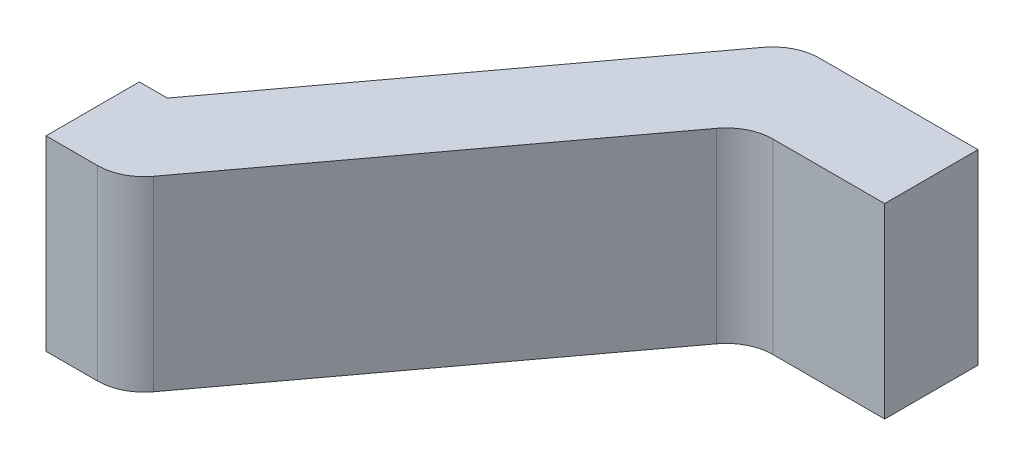
ISO-10303-21;
HEADER;
FILE_DESCRIPTION(('STEP AP214'),'2;1');
FILE_NAME('part.step','',(''),(''),'','','');
FILE_SCHEMA(('AUTOMOTIVE_DESIGN { 1 0 10303 214 1 1 1 1 }'));
ENDSEC;
DATA;
#1=APPLICATION_CONTEXT('core data for automotive mechanical design processes');
#2=APPLICATION_PROTOCOL_DEFINITION('international standard','automotive_design',2000,#1);
#3=PRODUCT_CONTEXT('',#1,'mechanical');
#4=PRODUCT('Part','Part','',(#3));
#5=PRODUCT_RELATED_PRODUCT_CATEGORY('part','',(#4));
#6=PRODUCT_DEFINITION_FORMATION('','',#4);
#7=PRODUCT_DEFINITION_CONTEXT('part definition',#1,'design');
#8=PRODUCT_DEFINITION('design','',#6,#7);
#9=PRODUCT_DEFINITION_SHAPE('','',#8);
#10=(LENGTH_UNIT() NAMED_UNIT(*) SI_UNIT(.MILLI.,.METRE.));
#11=(NAMED_UNIT(*) PLANE_ANGLE_UNIT() SI_UNIT($,.RADIAN.));
#12=(NAMED_UNIT(*) SI_UNIT($,.STERADIAN.) SOLID_ANGLE_UNIT());
#13=UNCERTAINTY_MEASURE_WITH_UNIT(LENGTH_MEASURE(1.E-05),#10,'distance_accuracy_value','');
#14=(GEOMETRIC_REPRESENTATION_CONTEXT(3) GLOBAL_UNCERTAINTY_ASSIGNED_CONTEXT((#13)) GLOBAL_UNIT_ASSIGNED_CONTEXT((#10,
#11,#12)) REPRESENTATION_CONTEXT('',''));
#15=CARTESIAN_POINT('',(0.,0.,0.));
#16=DIRECTION('',(0.,0.,1.));
#17=DIRECTION('',(1.,0.,0.));
#18=AXIS2_PLACEMENT_3D('',#15,#16,#17);
#19=CARTESIAN_POINT('',(2.6,-2.11,0.205));
#20=DIRECTION('',(0.,0.,1.));
#21=DIRECTION('',(1.,0.,0.));
#22=AXIS2_PLACEMENT_3D('',#19,#20,#21);
#23=PLANE('',#22);
#24=DIRECTION('',(1.,0.,0.));
#25=VECTOR('',#24,1.);
#26=CARTESIAN_POINT('',(2.6,-1.7,0.205));
#27=LINE('',#26,#25);
#28=CARTESIAN_POINT('',(2.754632601552,-1.7,0.205));
#29=VERTEX_POINT('',#28);
#30=CARTESIAN_POINT('',(3.,-1.7,0.205));
#31=VERTEX_POINT('',#30);
#32=EDGE_CURVE('E11',#29,#31,#27,.T.);
#33=ORIENTED_EDGE('',*,*,#32,.F.);
#34=DIRECTION('',(0.,1.,0.));
#35=VECTOR('',#34,1.);
#36=CARTESIAN_POINT('',(2.754632601552,-2.11,0.205));
#37=LINE('',#36,#35);
#38=CARTESIAN_POINT('',(2.754632601552,-2.11,0.205));
#39=VERTEX_POINT('',#38);
#40=EDGE_CURVE('E24',#39,#29,#37,.T.);
#41=ORIENTED_EDGE('',*,*,#40,.F.);
#42=DIRECTION('',(1.,0.,0.));
#43=VECTOR('',#42,1.);
#44=CARTESIAN_POINT('',(2.6,-2.11,0.205));
#45=LINE('',#44,#43);
#46=CARTESIAN_POINT('',(3.,-2.11,0.205));
#47=VERTEX_POINT('',#46);
#48=EDGE_CURVE('E172',#39,#47,#45,.T.);
#49=ORIENTED_EDGE('',*,*,#48,.T.);
#50=DIRECTION('',(0.,1.,0.));
#51=VECTOR('',#50,1.);
#52=CARTESIAN_POINT('',(3.,-2.11,0.205));
#53=LINE('',#52,#51);
#54=EDGE_CURVE('E170',#47,#31,#53,.T.);
#55=ORIENTED_EDGE('',*,*,#54,.T.);
#56=EDGE_LOOP('',(#33,#41,#49,#55));
#57=FACE_BOUND('',#56,.T.);
#58=ADVANCED_FACE('F17',(#57),#23,.T.);
#59=CARTESIAN_POINT('',(2.6,-1.7,0.));
#60=DIRECTION('',(0.,1.,0.));
#61=DIRECTION('',(0.,0.,1.));
#62=AXIS2_PLACEMENT_3D('',#59,#60,#61);
#63=PLANE('',#62);
#64=DIRECTION('',(1.,0.,0.));
#65=VECTOR('',#64,1.);
#66=CARTESIAN_POINT('',(2.6,-1.7,0.));
#67=LINE('',#66,#65);
#68=CARTESIAN_POINT('',(2.651544200517,-1.7,0.));
#69=VERTEX_POINT('',#68);
#70=CARTESIAN_POINT('',(3.,-1.7,0.));
#71=VERTEX_POINT('',#70);
#72=EDGE_CURVE('E168',#69,#71,#67,.T.);
#73=ORIENTED_EDGE('',*,*,#72,.F.);
#74=CARTESIAN_POINT('',(2.651544200517,-1.7,0.1025));
#75=DIRECTION('',(0.,1.,0.));
#76=DIRECTION('',(0.,0.,1.));
#77=AXIS2_PLACEMENT_3D('',#74,#75,#76);
#78=CIRCLE('',#77,0.1025);
#79=CARTESIAN_POINT('',(2.569262956102,-1.7,0.0413767898629));
#80=VERTEX_POINT('',#79);
#81=EDGE_CURVE('E118',#69,#80,#78,.T.);
#82=ORIENTED_EDGE('',*,*,#81,.T.);
#83=DIRECTION('',(-0.596324001338072,0.,0.802743847954097));
#84=VECTOR('',#83,1.);
#85=CARTESIAN_POINT('',(2.6,-1.7,0.));
#86=LINE('',#85,#84);
#87=CARTESIAN_POINT('',(2.011474087796,-1.7,0.792246420274));
#88=VERTEX_POINT('',#87);
#89=EDGE_CURVE('E165',#80,#88,#86,.T.);
#90=ORIENTED_EDGE('',*,*,#89,.T.);
#91=DIRECTION('',(1.,0.,0.));
#92=VECTOR('',#91,1.);
#93=CARTESIAN_POINT('',(1.95,-1.7,0.792246420274));
#94=LINE('',#93,#92);
#95=CARTESIAN_POINT('',(1.95,-1.7,0.792246420274));
#96=VERTEX_POINT('',#95);
#97=EDGE_CURVE('E162',#96,#88,#94,.T.);
#98=ORIENTED_EDGE('',*,*,#97,.F.);
#99=DIRECTION('',(0.,0.,1.));
#100=VECTOR('',#99,1.);
#101=CARTESIAN_POINT('',(1.95,-1.7,0.792246420274));
#102=LINE('',#101,#100);
#103=CARTESIAN_POINT('',(1.95,-1.7,0.997246420274));
#104=VERTEX_POINT('',#103);
#105=EDGE_CURVE('E160',#96,#104,#102,.T.);
#106=ORIENTED_EDGE('',*,*,#105,.T.);
#107=DIRECTION('',(1.,0.,0.));
#108=VECTOR('',#107,1.);
#109=CARTESIAN_POINT('',(1.95,-1.7,0.997246420274));
#110=LINE('',#109,#108);
#111=CARTESIAN_POINT('',(2.063018288313,-1.7,0.997246420274));
#112=VERTEX_POINT('',#111);
#113=EDGE_CURVE('E158',#104,#112,#110,.T.);
#114=ORIENTED_EDGE('',*,*,#113,.T.);
#115=CARTESIAN_POINT('',(2.063018288313,-1.7,0.894746420274));
#116=DIRECTION('',(0.,-1.,0.));
#117=DIRECTION('',(0.,0.,1.));
#118=AXIS2_PLACEMENT_3D('',#115,#116,#117);
#119=CIRCLE('',#118,0.1025);
#120=CARTESIAN_POINT('',(2.145299532729,-1.7,0.955869630411));
#121=VERTEX_POINT('',#120);
#122=EDGE_CURVE('E155',#121,#112,#119,.T.);
#123=ORIENTED_EDGE('',*,*,#122,.F.);
#124=DIRECTION('',(-0.596324001338072,0.,0.802743847954097));
#125=VECTOR('',#124,1.);
#126=CARTESIAN_POINT('',(2.764562488831,-1.7,0.122246420274));
#127=LINE('',#126,#125);
#128=CARTESIAN_POINT('',(2.672351357136,-1.7,0.246376789863));
#129=VERTEX_POINT('',#128);
#130=EDGE_CURVE('E152',#129,#121,#127,.T.);
#131=ORIENTED_EDGE('',*,*,#130,.F.);
#132=CARTESIAN_POINT('',(2.754632601552,-1.7,0.3075));
#133=DIRECTION('',(0.,1.,0.));
#134=DIRECTION('',(0.,0.,1.));
#135=AXIS2_PLACEMENT_3D('',#132,#133,#134);
#136=CIRCLE('',#135,0.1025);
#137=EDGE_CURVE('E149',#29,#129,#136,.T.);
#138=ORIENTED_EDGE('',*,*,#137,.F.);
#139=ORIENTED_EDGE('',*,*,#32,.T.);
#140=DIRECTION('',(0.,0.,1.));
#141=VECTOR('',#140,1.);
#142=CARTESIAN_POINT('',(3.,-1.7,0.));
#143=LINE('',#142,#141);
#144=EDGE_CURVE('E146',#71,#31,#143,.T.);
#145=ORIENTED_EDGE('',*,*,#144,.F.);
#146=EDGE_LOOP('',(#73,#82,#90,#98,#106,#114,#123,#131,#138,#139,#145));
#147=FACE_BOUND('',#146,.T.);
#148=ADVANCED_FACE('F178',(#147),#63,.T.);
#149=CARTESIAN_POINT('',(2.754632601552,-2.11,0.3075));
#150=DIRECTION('',(0.,1.,0.));
#151=DIRECTION('',(0.,0.,-1.));
#152=AXIS2_PLACEMENT_3D('',#149,#150,#151);
#153=CYLINDRICAL_SURFACE('',#152,0.1025);
#154=ORIENTED_EDGE('',*,*,#40,.T.);
#155=ORIENTED_EDGE('',*,*,#137,.T.);
#156=DIRECTION('',(0.,1.,0.));
#157=VECTOR('',#156,1.);
#158=CARTESIAN_POINT('',(2.672351357136,-2.11,0.246376789863));
#159=LINE('',#158,#157);
#160=CARTESIAN_POINT('',(2.672351357136,-2.11,0.246376789863));
#161=VERTEX_POINT('',#160);
#162=EDGE_CURVE('E143',#161,#129,#159,.T.);
#163=ORIENTED_EDGE('',*,*,#162,.F.);
#164=CARTESIAN_POINT('',(2.754632601552,-2.11,0.3075));
#165=DIRECTION('',(0.,1.,0.));
#166=DIRECTION('',(0.,0.,1.));
#167=AXIS2_PLACEMENT_3D('',#164,#165,#166);
#168=CIRCLE('',#167,0.1025);
#169=EDGE_CURVE('E141',#39,#161,#168,.T.);
#170=ORIENTED_EDGE('',*,*,#169,.F.);
#171=EDGE_LOOP('',(#154,#155,#163,#170));
#172=FACE_BOUND('',#171,.T.);
#173=ADVANCED_FACE('F175',(#172),#153,.F.);
#174=CARTESIAN_POINT('',(3.,-2.11,0.));
#175=DIRECTION('',(1.,0.,0.));
#176=DIRECTION('',(0.,0.,1.));
#177=AXIS2_PLACEMENT_3D('',#174,#175,#176);
#178=PLANE('',#177);
#179=DIRECTION('',(0.,0.,1.));
#180=VECTOR('',#179,1.);
#181=CARTESIAN_POINT('',(3.,-2.11,0.));
#182=LINE('',#181,#180);
#183=CARTESIAN_POINT('',(3.,-2.11,0.));
#184=VERTEX_POINT('',#183);
#185=EDGE_CURVE('E139',#184,#47,#182,.T.);
#186=ORIENTED_EDGE('',*,*,#185,.F.);
#187=DIRECTION('',(0.,1.,0.));
#188=VECTOR('',#187,1.);
#189=CARTESIAN_POINT('',(3.,-2.11,0.));
#190=LINE('',#189,#188);
#191=EDGE_CURVE('E103',#184,#71,#190,.T.);
#192=ORIENTED_EDGE('',*,*,#191,.T.);
#193=ORIENTED_EDGE('',*,*,#144,.T.);
#194=ORIENTED_EDGE('',*,*,#54,.F.);
#195=EDGE_LOOP('',(#186,#192,#193,#194));
#196=FACE_BOUND('',#195,.T.);
#197=ADVANCED_FACE('F217',(#196),#178,.T.);
#198=CARTESIAN_POINT('',(2.6,-2.11,0.));
#199=DIRECTION('',(0.,1.,0.));
#200=DIRECTION('',(0.,0.,1.));
#201=AXIS2_PLACEMENT_3D('',#198,#199,#200);
#202=PLANE('',#201);
#203=ORIENTED_EDGE('',*,*,#185,.T.);
#204=ORIENTED_EDGE('',*,*,#48,.F.);
#205=ORIENTED_EDGE('',*,*,#169,.T.);
#206=DIRECTION('',(-0.596324001338072,0.,0.802743847954097));
#207=VECTOR('',#206,1.);
#208=CARTESIAN_POINT('',(2.764562488831,-2.11,0.122246420274));
#209=LINE('',#208,#207);
#210=CARTESIAN_POINT('',(2.145299532729,-2.11,0.955869630411));
#211=VERTEX_POINT('',#210);
#212=EDGE_CURVE('E135',#161,#211,#209,.T.);
#213=ORIENTED_EDGE('',*,*,#212,.T.);
#214=CARTESIAN_POINT('',(2.063018288313,-2.11,0.894746420274));
#215=DIRECTION('',(0.,-1.,0.));
#216=DIRECTION('',(0.,0.,1.));
#217=AXIS2_PLACEMENT_3D('',#214,#215,#216);
#218=CIRCLE('',#217,0.1025);
#219=CARTESIAN_POINT('',(2.063018288313,-2.11,0.997246420274));
#220=VERTEX_POINT('',#219);
#221=EDGE_CURVE('E132',#211,#220,#218,.T.);
#222=ORIENTED_EDGE('',*,*,#221,.T.);
#223=DIRECTION('',(1.,0.,0.));
#224=VECTOR('',#223,1.);
#225=CARTESIAN_POINT('',(1.95,-2.11,0.997246420274));
#226=LINE('',#225,#224);
#227=CARTESIAN_POINT('',(1.95,-2.11,0.997246420274));
#228=VERTEX_POINT('',#227);
#229=EDGE_CURVE('E130',#228,#220,#226,.T.);
#230=ORIENTED_EDGE('',*,*,#229,.F.);
#231=DIRECTION('',(0.,0.,1.));
#232=VECTOR('',#231,1.);
#233=CARTESIAN_POINT('',(1.95,-2.11,0.792246420274));
#234=LINE('',#233,#232);
#235=CARTESIAN_POINT('',(1.95,-2.11,0.792246420274));
#236=VERTEX_POINT('',#235);
#237=EDGE_CURVE('E128',#236,#228,#234,.T.);
#238=ORIENTED_EDGE('',*,*,#237,.F.);
#239=DIRECTION('',(1.,0.,0.));
#240=VECTOR('',#239,1.);
#241=CARTESIAN_POINT('',(1.95,-2.11,0.792246420274));
#242=LINE('',#241,#240);
#243=CARTESIAN_POINT('',(2.011474087796,-2.11,0.792246420274));
#244=VERTEX_POINT('',#243);
#245=EDGE_CURVE('E126',#236,#244,#242,.T.);
#246=ORIENTED_EDGE('',*,*,#245,.T.);
#247=DIRECTION('',(-0.596324001338072,0.,0.802743847954097));
#248=VECTOR('',#247,1.);
#249=CARTESIAN_POINT('',(2.6,-2.11,0.));
#250=LINE('',#249,#248);
#251=CARTESIAN_POINT('',(2.569262956102,-2.11,0.0413767898629));
#252=VERTEX_POINT('',#251);
#253=EDGE_CURVE('E111',#252,#244,#250,.T.);
#254=ORIENTED_EDGE('',*,*,#253,.F.);
#255=CARTESIAN_POINT('',(2.651544200517,-2.11,0.1025));
#256=DIRECTION('',(0.,1.,0.));
#257=DIRECTION('',(0.,0.,1.));
#258=AXIS2_PLACEMENT_3D('',#255,#256,#257);
#259=CIRCLE('',#258,0.1025);
#260=CARTESIAN_POINT('',(2.651544200517,-2.11,0.));
#261=VERTEX_POINT('',#260);
#262=EDGE_CURVE('E106',#261,#252,#259,.T.);
#263=ORIENTED_EDGE('',*,*,#262,.F.);
#264=DIRECTION('',(1.,0.,0.));
#265=VECTOR('',#264,1.);
#266=CARTESIAN_POINT('',(2.6,-2.11,0.));
#267=LINE('',#266,#265);
#268=EDGE_CURVE('E97',#261,#184,#267,.T.);
#269=ORIENTED_EDGE('',*,*,#268,.T.);
#270=EDGE_LOOP('',(#203,#204,#205,#213,#222,#230,#238,#246,#254,#263,#269));
#271=FACE_BOUND('',#270,.T.);
#272=ADVANCED_FACE('F109',(#271),#202,.F.);
#273=CARTESIAN_POINT('',(2.6,-2.11,0.));
#274=DIRECTION('',(0.,0.,1.));
#275=DIRECTION('',(1.,0.,0.));
#276=AXIS2_PLACEMENT_3D('',#273,#274,#275);
#277=PLANE('',#276);
#278=DIRECTION('',(0.,1.,0.));
#279=VECTOR('',#278,1.);
#280=CARTESIAN_POINT('',(2.651544200517,-2.11,0.));
#281=LINE('',#280,#279);
#282=EDGE_CURVE('E101',#261,#69,#281,.T.);
#283=ORIENTED_EDGE('',*,*,#282,.T.);
#284=ORIENTED_EDGE('',*,*,#72,.T.);
#285=ORIENTED_EDGE('',*,*,#191,.F.);
#286=ORIENTED_EDGE('',*,*,#268,.F.);
#287=EDGE_LOOP('',(#283,#284,#285,#286));
#288=FACE_BOUND('',#287,.T.);
#289=ADVANCED_FACE('F99',(#288),#277,.F.);
#290=CARTESIAN_POINT('',(2.651544200517,-2.11,0.1025));
#291=DIRECTION('',(0.,1.,0.));
#292=DIRECTION('',(0.,0.,-1.));
#293=AXIS2_PLACEMENT_3D('',#290,#291,#292);
#294=CYLINDRICAL_SURFACE('',#293,0.1025);
#295=ORIENTED_EDGE('',*,*,#262,.T.);
#296=DIRECTION('',(0.,1.,0.));
#297=VECTOR('',#296,1.);
#298=CARTESIAN_POINT('',(2.569262956102,-2.11,0.0413767898629));
#299=LINE('',#298,#297);
#300=EDGE_CURVE('E119',#252,#80,#299,.T.);
#301=ORIENTED_EDGE('',*,*,#300,.T.);
#302=ORIENTED_EDGE('',*,*,#81,.F.);
#303=ORIENTED_EDGE('',*,*,#282,.F.);
#304=EDGE_LOOP('',(#295,#301,#302,#303));
#305=FACE_BOUND('',#304,.T.);
#306=ADVANCED_FACE('F117',(#305),#294,.T.);
#307=CARTESIAN_POINT('',(2.6,-2.11,0.));
#308=DIRECTION('',(0.802743847954097,0.,0.596324001338072));
#309=DIRECTION('',(-0.596324001338072,0.,0.802743847954097));
#310=AXIS2_PLACEMENT_3D('',#307,#308,#309);
#311=PLANE('',#310);
#312=DIRECTION('',(0.,1.,0.));
#313=VECTOR('',#312,1.);
#314=CARTESIAN_POINT('',(2.011474087796,-2.11,0.792246420274));
#315=LINE('',#314,#313);
#316=EDGE_CURVE('E121',#244,#88,#315,.T.);
#317=ORIENTED_EDGE('',*,*,#316,.T.);
#318=ORIENTED_EDGE('',*,*,#89,.F.);
#319=ORIENTED_EDGE('',*,*,#300,.F.);
#320=ORIENTED_EDGE('',*,*,#253,.T.);
#321=EDGE_LOOP('',(#317,#318,#319,#320));
#322=FACE_BOUND('',#321,.T.);
#323=ADVANCED_FACE('F202',(#322),#311,.F.);
#324=CARTESIAN_POINT('',(1.95,-2.11,0.792246420274));
#325=DIRECTION('',(0.,0.,1.));
#326=DIRECTION('',(1.,0.,0.));
#327=AXIS2_PLACEMENT_3D('',#324,#325,#326);
#328=PLANE('',#327);
#329=ORIENTED_EDGE('',*,*,#316,.F.);
#330=ORIENTED_EDGE('',*,*,#245,.F.);
#331=DIRECTION('',(0.,1.,0.));
#332=VECTOR('',#331,1.);
#333=CARTESIAN_POINT('',(1.95,-2.11,0.792246420274));
#334=LINE('',#333,#332);
#335=EDGE_CURVE('E193',#236,#96,#334,.T.);
#336=ORIENTED_EDGE('',*,*,#335,.T.);
#337=ORIENTED_EDGE('',*,*,#97,.T.);
#338=EDGE_LOOP('',(#329,#330,#336,#337));
#339=FACE_BOUND('',#338,.T.);
#340=ADVANCED_FACE('F204',(#339),#328,.F.);
#341=CARTESIAN_POINT('',(1.95,-2.11,0.792246420274));
#342=DIRECTION('',(1.,0.,0.));
#343=DIRECTION('',(0.,0.,1.));
#344=AXIS2_PLACEMENT_3D('',#341,#342,#343);
#345=PLANE('',#344);
#346=ORIENTED_EDGE('',*,*,#237,.T.);
#347=DIRECTION('',(0.,1.,0.));
#348=VECTOR('',#347,1.);
#349=CARTESIAN_POINT('',(1.95,-2.11,0.997246420274));
#350=LINE('',#349,#348);
#351=EDGE_CURVE('E189',#228,#104,#350,.T.);
#352=ORIENTED_EDGE('',*,*,#351,.T.);
#353=ORIENTED_EDGE('',*,*,#105,.F.);
#354=ORIENTED_EDGE('',*,*,#335,.F.);
#355=EDGE_LOOP('',(#346,#352,#353,#354));
#356=FACE_BOUND('',#355,.T.);
#357=ADVANCED_FACE('F210',(#356),#345,.F.);
#358=CARTESIAN_POINT('',(2.764562488831,-2.11,0.122246420274));
#359=DIRECTION('',(0.802743847954097,0.,0.596324001338072));
#360=DIRECTION('',(-0.596324001338072,0.,0.802743847954097));
#361=AXIS2_PLACEMENT_3D('',#358,#359,#360);
#362=PLANE('',#361);
#363=ORIENTED_EDGE('',*,*,#212,.F.);
#364=ORIENTED_EDGE('',*,*,#162,.T.);
#365=ORIENTED_EDGE('',*,*,#130,.T.);
#366=DIRECTION('',(0.,1.,0.));
#367=VECTOR('',#366,1.);
#368=CARTESIAN_POINT('',(2.145299532729,-2.11,0.955869630411));
#369=LINE('',#368,#367);
#370=EDGE_CURVE('E184',#211,#121,#369,.T.);
#371=ORIENTED_EDGE('',*,*,#370,.F.);
#372=EDGE_LOOP('',(#363,#364,#365,#371));
#373=FACE_BOUND('',#372,.T.);
#374=ADVANCED_FACE('F183',(#373),#362,.T.);
#375=CARTESIAN_POINT('',(1.95,-2.11,0.997246420274));
#376=DIRECTION('',(0.,0.,1.));
#377=DIRECTION('',(1.,0.,0.));
#378=AXIS2_PLACEMENT_3D('',#375,#376,#377);
#379=PLANE('',#378);
#380=ORIENTED_EDGE('',*,*,#113,.F.);
#381=ORIENTED_EDGE('',*,*,#351,.F.);
#382=ORIENTED_EDGE('',*,*,#229,.T.);
#383=DIRECTION('',(0.,1.,0.));
#384=VECTOR('',#383,1.);
#385=CARTESIAN_POINT('',(2.063018288313,-2.11,0.997246420274));
#386=LINE('',#385,#384);
#387=EDGE_CURVE('E190',#220,#112,#386,.T.);
#388=ORIENTED_EDGE('',*,*,#387,.T.);
#389=EDGE_LOOP('',(#380,#381,#382,#388));
#390=FACE_BOUND('',#389,.T.);
#391=ADVANCED_FACE('F214',(#390),#379,.T.);
#392=CARTESIAN_POINT('',(2.063018288313,-2.11,0.894746420274));
#393=DIRECTION('',(0.,1.,0.));
#394=DIRECTION('',(0.802743847954097,0.,0.596324001338072));
#395=AXIS2_PLACEMENT_3D('',#392,#393,#394);
#396=CYLINDRICAL_SURFACE('',#395,0.1025);
#397=ORIENTED_EDGE('',*,*,#370,.T.);
#398=ORIENTED_EDGE('',*,*,#122,.T.);
#399=ORIENTED_EDGE('',*,*,#387,.F.);
#400=ORIENTED_EDGE('',*,*,#221,.F.);
#401=EDGE_LOOP('',(#397,#398,#399,#400));
#402=FACE_BOUND('',#401,.T.);
#403=ADVANCED_FACE('F186',(#402),#396,.T.);
#404=CLOSED_SHELL('',(#58,#148,#173,#197,#272,#289,#306,#323,#340,#357,#374,#391,#403));
#405=MANIFOLD_SOLID_BREP('B1',#404);
#406=ADVANCED_BREP_SHAPE_REPRESENTATION('',(#18,#405),#14);
#407=SHAPE_DEFINITION_REPRESENTATION(#9,#406);
ENDSEC;
END-ISO-10303-21;
